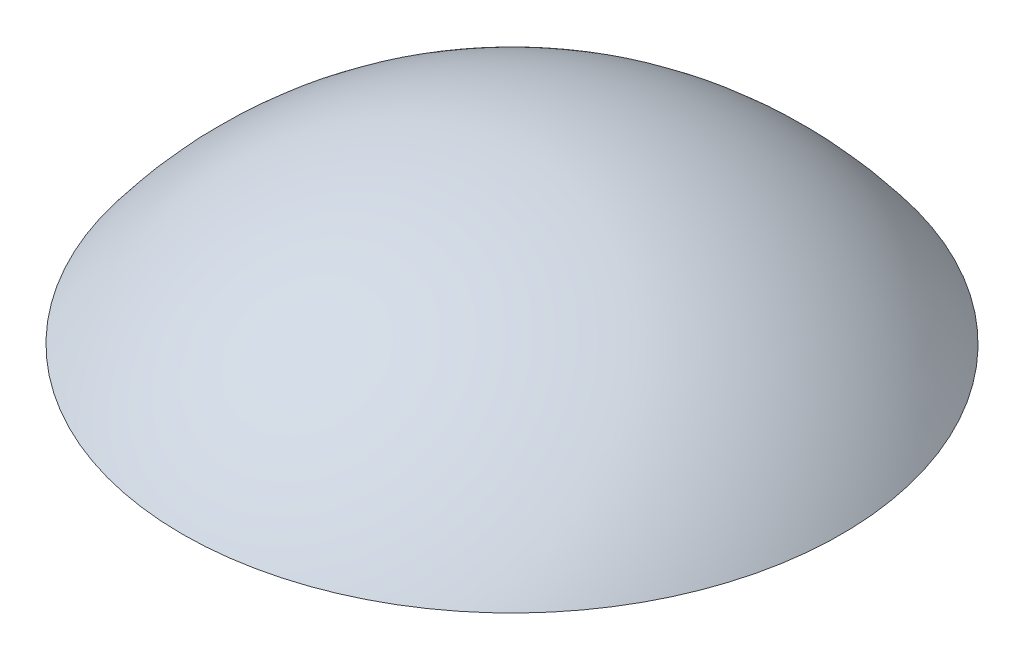
ISO-10303-21;
HEADER;
FILE_DESCRIPTION(('STEP AP214'),'2;1');
FILE_NAME('part.step','',(''),(''),'','','');
FILE_SCHEMA(('AUTOMOTIVE_DESIGN { 1 0 10303 214 1 1 1 1 }'));
ENDSEC;
DATA;
#1=APPLICATION_CONTEXT('core data for automotive mechanical design processes');
#2=APPLICATION_PROTOCOL_DEFINITION('international standard','automotive_design',2000,#1);
#3=PRODUCT_CONTEXT('',#1,'mechanical');
#4=PRODUCT('Part','Part','',(#3));
#5=PRODUCT_RELATED_PRODUCT_CATEGORY('part','',(#4));
#6=PRODUCT_DEFINITION_FORMATION('','',#4);
#7=PRODUCT_DEFINITION_CONTEXT('part definition',#1,'design');
#8=PRODUCT_DEFINITION('design','',#6,#7);
#9=PRODUCT_DEFINITION_SHAPE('','',#8);
#10=(LENGTH_UNIT() NAMED_UNIT(*) SI_UNIT(.MILLI.,.METRE.));
#11=(NAMED_UNIT(*) PLANE_ANGLE_UNIT() SI_UNIT($,.RADIAN.));
#12=(NAMED_UNIT(*) SI_UNIT($,.STERADIAN.) SOLID_ANGLE_UNIT());
#13=UNCERTAINTY_MEASURE_WITH_UNIT(LENGTH_MEASURE(1.E-05),#10,'distance_accuracy_value','');
#14=(GEOMETRIC_REPRESENTATION_CONTEXT(3) GLOBAL_UNCERTAINTY_ASSIGNED_CONTEXT((#13)) GLOBAL_UNIT_ASSIGNED_CONTEXT((#10,
#11,#12)) REPRESENTATION_CONTEXT('',''));
#15=CARTESIAN_POINT('',(0.,0.,0.));
#16=DIRECTION('',(0.,0.,1.));
#17=DIRECTION('',(1.,0.,0.));
#18=AXIS2_PLACEMENT_3D('',#15,#16,#17);
#19=CARTESIAN_POINT('',(0.,0.,-25.4));
#20=DIRECTION('',(0.,1.,0.));
#21=DIRECTION('',(0.,0.,1.));
#22=AXIS2_PLACEMENT_3D('',#19,#20,#21);
#23=PLANE('',#22);
#24=CARTESIAN_POINT('',(0.,0.,0.));
#25=DIRECTION('',(0.,1.,0.));
#26=DIRECTION('',(0.,0.,1.));
#27=AXIS2_PLACEMENT_3D('',#24,#25,#26);
#28=CIRCLE('',#27,25.4);
#29=CARTESIAN_POINT('',(0.,0.,25.4));
#30=VERTEX_POINT('',#29);
#31=EDGE_CURVE('E10',#30,#30,#28,.T.);
#32=ORIENTED_EDGE('',*,*,#31,.F.);
#33=EDGE_LOOP('',(#32));
#34=FACE_BOUND('',#33,.T.);
#35=ADVANCED_FACE('F32',(#34),#23,.F.);
#36=CARTESIAN_POINT('',(0.,-19.0500000000002,1.07552855510562E-13));
#37=DIRECTION('',(0.,1.,0.));
#38=DIRECTION('',(0.,0.,-1.));
#39=AXIS2_PLACEMENT_3D('',#36,#37,#38);
#40=SPHERICAL_SURFACE('',#39,31.7500000000002);
#41=ORIENTED_EDGE('',*,*,#31,.T.);
#42=EDGE_LOOP('',(#41));
#43=FACE_BOUND('',#42,.T.);
#44=ADVANCED_FACE('F39',(#43),#40,.T.);
#45=CLOSED_SHELL('',(#35,#44));
#46=MANIFOLD_SOLID_BREP('B2',#45);
#47=ADVANCED_BREP_SHAPE_REPRESENTATION('',(#18,#46),#14);
#48=SHAPE_DEFINITION_REPRESENTATION(#9,#47);
ENDSEC;
END-ISO-10303-21;
